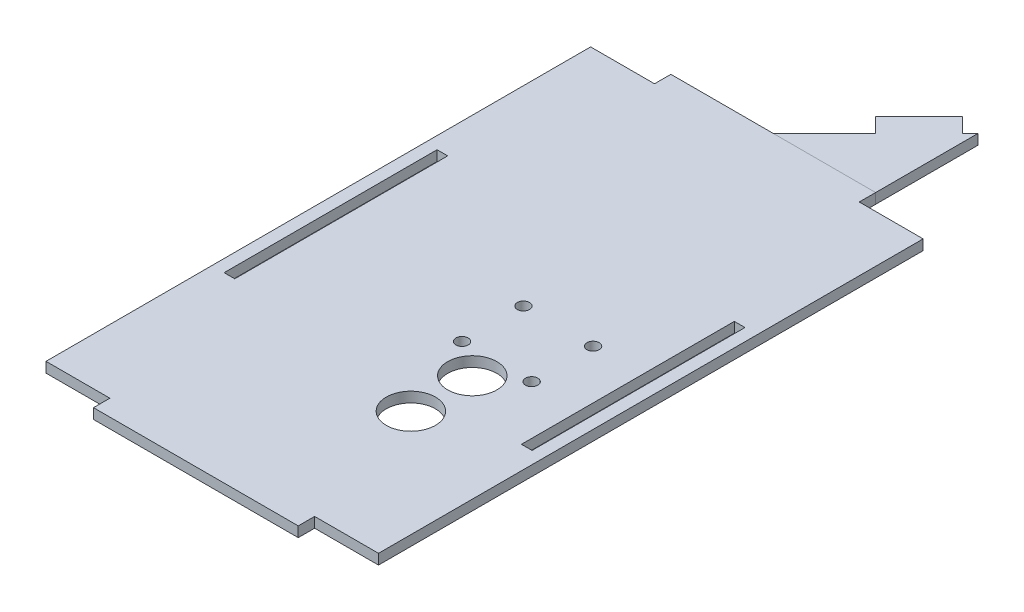
ISO-10303-21;
HEADER;
FILE_DESCRIPTION(('STEP AP214'),'2;1');
FILE_NAME('part.step','',(''),(''),'','','');
FILE_SCHEMA(('AUTOMOTIVE_DESIGN { 1 0 10303 214 1 1 1 1 }'));
ENDSEC;
DATA;
#1=APPLICATION_CONTEXT('core data for automotive mechanical design processes');
#2=APPLICATION_PROTOCOL_DEFINITION('international standard','automotive_design',2000,#1);
#3=PRODUCT_CONTEXT('',#1,'mechanical');
#4=PRODUCT('Part','Part','',(#3));
#5=PRODUCT_RELATED_PRODUCT_CATEGORY('part','',(#4));
#6=PRODUCT_DEFINITION_FORMATION('','',#4);
#7=PRODUCT_DEFINITION_CONTEXT('part definition',#1,'design');
#8=PRODUCT_DEFINITION('design','',#6,#7);
#9=PRODUCT_DEFINITION_SHAPE('','',#8);
#10=(LENGTH_UNIT() NAMED_UNIT(*) SI_UNIT(.MILLI.,.METRE.));
#11=(NAMED_UNIT(*) PLANE_ANGLE_UNIT() SI_UNIT($,.RADIAN.));
#12=(NAMED_UNIT(*) SI_UNIT($,.STERADIAN.) SOLID_ANGLE_UNIT());
#13=UNCERTAINTY_MEASURE_WITH_UNIT(LENGTH_MEASURE(1.E-05),#10,'distance_accuracy_value','');
#14=(GEOMETRIC_REPRESENTATION_CONTEXT(3) GLOBAL_UNCERTAINTY_ASSIGNED_CONTEXT((#13)) GLOBAL_UNIT_ASSIGNED_CONTEXT((#10,
#11,#12)) REPRESENTATION_CONTEXT('',''));
#15=CARTESIAN_POINT('',(0.,0.,0.));
#16=DIRECTION('',(0.,0.,1.));
#17=DIRECTION('',(1.,0.,0.));
#18=AXIS2_PLACEMENT_3D('',#15,#16,#17);
#19=CARTESIAN_POINT('',(-35.25,0.,-35.2499999999994));
#20=DIRECTION('',(0.707106781186553,0.,0.707106781186542));
#21=DIRECTION('',(0.707106781186542,0.,-0.707106781186553));
#22=AXIS2_PLACEMENT_3D('',#19,#20,#21);
#23=PLANE('',#22);
#24=DIRECTION('',(0.707106781186542,0.,-0.707106781186553));
#25=VECTOR('',#24,1.);
#26=CARTESIAN_POINT('',(-35.25,2.5,-35.2499999999994));
#27=LINE('',#26,#25);
#28=CARTESIAN_POINT('',(23.1066017177981,2.5,-93.6066017177986));
#29=VERTEX_POINT('',#28);
#30=CARTESIAN_POINT('',(25.,2.5,-95.5000000000004));
#31=VERTEX_POINT('',#30);
#32=EDGE_CURVE('E139',#29,#31,#27,.T.);
#33=ORIENTED_EDGE('',*,*,#32,.T.);
#34=DIRECTION('',(0.,1.,0.));
#35=VECTOR('',#34,1.);
#36=CARTESIAN_POINT('',(25.,0.,-95.5000000000004));
#37=LINE('',#36,#35);
#38=CARTESIAN_POINT('',(25.,0.,-95.5000000000004));
#39=VERTEX_POINT('',#38);
#40=EDGE_CURVE('E12',#39,#31,#37,.T.);
#41=ORIENTED_EDGE('',*,*,#40,.F.);
#42=DIRECTION('',(0.707106781186542,0.,-0.707106781186553));
#43=VECTOR('',#42,1.);
#44=CARTESIAN_POINT('',(-35.25,0.,-35.2499999999994));
#45=LINE('',#44,#43);
#46=CARTESIAN_POINT('',(23.1066017177981,0.,-93.6066017177986));
#47=VERTEX_POINT('',#46);
#48=EDGE_CURVE('E151',#47,#39,#45,.T.);
#49=ORIENTED_EDGE('',*,*,#48,.F.);
#50=DIRECTION('',(0.,1.,0.));
#51=VECTOR('',#50,1.);
#52=CARTESIAN_POINT('',(23.1066017177981,0.,-93.6066017177986));
#53=LINE('',#52,#51);
#54=EDGE_CURVE('E53',#47,#29,#53,.T.);
#55=ORIENTED_EDGE('',*,*,#54,.T.);
#56=EDGE_LOOP('',(#33,#41,#49,#55));
#57=FACE_BOUND('',#56,.T.);
#58=ADVANCED_FACE('F50',(#57),#23,.F.);
#59=CARTESIAN_POINT('',(25.,0.,0.));
#60=DIRECTION('',(-1.,0.,0.));
#61=DIRECTION('',(0.,0.,1.));
#62=AXIS2_PLACEMENT_3D('',#59,#60,#61);
#63=PLANE('',#62);
#64=DIRECTION('',(0.,0.,1.));
#65=VECTOR('',#64,1.);
#66=CARTESIAN_POINT('',(25.,2.5,0.));
#67=LINE('',#66,#65);
#68=CARTESIAN_POINT('',(25.,2.5,-70.5000000000002));
#69=VERTEX_POINT('',#68);
#70=EDGE_CURVE('E90',#31,#69,#67,.T.);
#71=ORIENTED_EDGE('',*,*,#70,.T.);
#72=DIRECTION('',(0.,1.,0.));
#73=VECTOR('',#72,1.);
#74=CARTESIAN_POINT('',(25.,0.,-70.5000000000002));
#75=LINE('',#74,#73);
#76=CARTESIAN_POINT('',(25.,0.,-70.5000000000002));
#77=VERTEX_POINT('',#76);
#78=EDGE_CURVE('E59',#77,#69,#75,.T.);
#79=ORIENTED_EDGE('',*,*,#78,.F.);
#80=DIRECTION('',(0.,0.,1.));
#81=VECTOR('',#80,1.);
#82=CARTESIAN_POINT('',(25.,0.,0.));
#83=LINE('',#82,#81);
#84=EDGE_CURVE('E67',#39,#77,#83,.T.);
#85=ORIENTED_EDGE('',*,*,#84,.F.);
#86=ORIENTED_EDGE('',*,*,#40,.T.);
#87=EDGE_LOOP('',(#71,#79,#85,#86));
#88=FACE_BOUND('',#87,.T.);
#89=ADVANCED_FACE('F181',(#88),#63,.F.);
#90=CARTESIAN_POINT('',(0.,0.,-70.5000000000002));
#91=DIRECTION('',(0.,0.,-1.));
#92=DIRECTION('',(-1.,0.,0.));
#93=AXIS2_PLACEMENT_3D('',#90,#91,#92);
#94=PLANE('',#93);
#95=DIRECTION('',(-1.,0.,0.));
#96=VECTOR('',#95,1.);
#97=CARTESIAN_POINT('',(0.,2.5,-70.5000000000002));
#98=LINE('',#97,#96);
#99=CARTESIAN_POINT('',(0.,2.5,-70.5000000000002));
#100=VERTEX_POINT('',#99);
#101=EDGE_CURVE('E124',#69,#100,#98,.T.);
#102=ORIENTED_EDGE('',*,*,#101,.T.);
#103=DIRECTION('',(0.,1.,0.));
#104=VECTOR('',#103,1.);
#105=CARTESIAN_POINT('',(0.,0.,-70.5000000000002));
#106=LINE('',#105,#104);
#107=CARTESIAN_POINT('',(0.,0.,-70.5000000000002));
#108=VERTEX_POINT('',#107);
#109=EDGE_CURVE('E122',#108,#100,#106,.T.);
#110=ORIENTED_EDGE('',*,*,#109,.F.);
#111=DIRECTION('',(-1.,0.,0.));
#112=VECTOR('',#111,1.);
#113=CARTESIAN_POINT('',(0.,0.,-70.5000000000002));
#114=LINE('',#113,#112);
#115=EDGE_CURVE('E113',#77,#108,#114,.T.);
#116=ORIENTED_EDGE('',*,*,#115,.F.);
#117=ORIENTED_EDGE('',*,*,#78,.T.);
#118=EDGE_LOOP('',(#102,#110,#116,#117));
#119=FACE_BOUND('',#118,.T.);
#120=ADVANCED_FACE('F123',(#119),#94,.F.);
#121=CARTESIAN_POINT('',(-35.2500000000001,0.,-35.2499999999998));
#122=DIRECTION('',(0.707106781186551,0.,0.707106781186545));
#123=DIRECTION('',(0.707106781186545,0.,-0.707106781186551));
#124=AXIS2_PLACEMENT_3D('',#121,#122,#123);
#125=PLANE('',#124);
#126=DIRECTION('',(0.707106781186545,0.,-0.707106781186551));
#127=VECTOR('',#126,1.);
#128=CARTESIAN_POINT('',(-35.2500000000001,2.5,-35.2499999999998));
#129=LINE('',#128,#127);
#130=CARTESIAN_POINT('',(12.5,2.5,-83.0000000000003));
#131=VERTEX_POINT('',#130);
#132=EDGE_CURVE('E148',#100,#131,#129,.T.);
#133=ORIENTED_EDGE('',*,*,#132,.T.);
#134=DIRECTION('',(0.,1.,0.));
#135=VECTOR('',#134,1.);
#136=CARTESIAN_POINT('',(12.5,0.,-83.0000000000003));
#137=LINE('',#136,#135);
#138=CARTESIAN_POINT('',(12.5,0.,-83.0000000000003));
#139=VERTEX_POINT('',#138);
#140=EDGE_CURVE('E127',#139,#131,#137,.T.);
#141=ORIENTED_EDGE('',*,*,#140,.F.);
#142=DIRECTION('',(0.707106781186545,0.,-0.707106781186551));
#143=VECTOR('',#142,1.);
#144=CARTESIAN_POINT('',(-35.2500000000001,0.,-35.2499999999998));
#145=LINE('',#144,#143);
#146=EDGE_CURVE('E117',#108,#139,#145,.T.);
#147=ORIENTED_EDGE('',*,*,#146,.F.);
#148=ORIENTED_EDGE('',*,*,#109,.T.);
#149=EDGE_LOOP('',(#133,#141,#147,#148));
#150=FACE_BOUND('',#149,.T.);
#151=ADVANCED_FACE('F129',(#150),#125,.F.);
#152=CARTESIAN_POINT('',(47.7500000000001,0.,-47.7500000000007));
#153=DIRECTION('',(0.707106781186543,0.,-0.707106781186552));
#154=DIRECTION('',(-0.707106781186552,0.,-0.707106781186543));
#155=AXIS2_PLACEMENT_3D('',#152,#153,#154);
#156=PLANE('',#155);
#157=DIRECTION('',(-0.707106781186552,0.,-0.707106781186543));
#158=VECTOR('',#157,1.);
#159=CARTESIAN_POINT('',(47.7500000000001,2.5,-47.7500000000007));
#160=LINE('',#159,#158);
#161=CARTESIAN_POINT('',(8.96446609406724,2.5,-86.535533905933));
#162=VERTEX_POINT('',#161);
#163=EDGE_CURVE('E146',#131,#162,#160,.T.);
#164=ORIENTED_EDGE('',*,*,#163,.T.);
#165=DIRECTION('',(0.,1.,0.));
#166=VECTOR('',#165,1.);
#167=CARTESIAN_POINT('',(8.96446609406724,0.,-86.535533905933));
#168=LINE('',#167,#166);
#169=CARTESIAN_POINT('',(8.96446609406724,0.,-86.535533905933));
#170=VERTEX_POINT('',#169);
#171=EDGE_CURVE('E155',#170,#162,#168,.T.);
#172=ORIENTED_EDGE('',*,*,#171,.F.);
#173=DIRECTION('',(-0.707106781186552,0.,-0.707106781186543));
#174=VECTOR('',#173,1.);
#175=CARTESIAN_POINT('',(47.7500000000001,0.,-47.7500000000007));
#176=LINE('',#175,#174);
#177=EDGE_CURVE('E132',#139,#170,#176,.T.);
#178=ORIENTED_EDGE('',*,*,#177,.F.);
#179=ORIENTED_EDGE('',*,*,#140,.T.);
#180=EDGE_LOOP('',(#164,#172,#178,#179));
#181=FACE_BOUND('',#180,.T.);
#182=ADVANCED_FACE('F177',(#181),#156,.F.);
#183=CARTESIAN_POINT('',(-38.7855339059328,0.,-38.7855339059324));
#184=DIRECTION('',(0.707106781186551,0.,0.707106781186544));
#185=DIRECTION('',(0.707106781186544,0.,-0.707106781186551));
#186=AXIS2_PLACEMENT_3D('',#183,#184,#185);
#187=PLANE('',#186);
#188=DIRECTION('',(0.707106781186544,0.,-0.707106781186551));
#189=VECTOR('',#188,1.);
#190=CARTESIAN_POINT('',(-38.7855339059328,2.5,-38.7855339059324));
#191=LINE('',#190,#189);
#192=CARTESIAN_POINT('',(19.5710678118654,2.5,-97.1421356237313));
#193=VERTEX_POINT('',#192);
#194=EDGE_CURVE('E144',#162,#193,#191,.T.);
#195=ORIENTED_EDGE('',*,*,#194,.T.);
#196=DIRECTION('',(0.,1.,0.));
#197=VECTOR('',#196,1.);
#198=CARTESIAN_POINT('',(19.5710678118654,0.,-97.1421356237313));
#199=LINE('',#198,#197);
#200=CARTESIAN_POINT('',(19.5710678118654,0.,-97.1421356237313));
#201=VERTEX_POINT('',#200);
#202=EDGE_CURVE('E157',#201,#193,#199,.T.);
#203=ORIENTED_EDGE('',*,*,#202,.F.);
#204=DIRECTION('',(0.707106781186544,0.,-0.707106781186551));
#205=VECTOR('',#204,1.);
#206=CARTESIAN_POINT('',(-38.7855339059328,0.,-38.7855339059324));
#207=LINE('',#206,#205);
#208=EDGE_CURVE('E134',#170,#201,#207,.T.);
#209=ORIENTED_EDGE('',*,*,#208,.F.);
#210=ORIENTED_EDGE('',*,*,#171,.T.);
#211=EDGE_LOOP('',(#195,#203,#209,#210));
#212=FACE_BOUND('',#211,.T.);
#213=ADVANCED_FACE('F171',(#212),#187,.F.);
#214=CARTESIAN_POINT('',(58.3566017177982,0.,-58.356601717799));
#215=DIRECTION('',(-0.707106781186543,0.,0.707106781186552));
#216=DIRECTION('',(0.707106781186552,0.,0.707106781186543));
#217=AXIS2_PLACEMENT_3D('',#214,#215,#216);
#218=PLANE('',#217);
#219=DIRECTION('',(0.707106781186552,0.,0.707106781186543));
#220=VECTOR('',#219,1.);
#221=CARTESIAN_POINT('',(58.3566017177982,2.5,-58.356601717799));
#222=LINE('',#221,#220);
#223=EDGE_CURVE('E142',#193,#29,#222,.T.);
#224=ORIENTED_EDGE('',*,*,#223,.T.);
#225=ORIENTED_EDGE('',*,*,#54,.F.);
#226=DIRECTION('',(0.707106781186552,0.,0.707106781186543));
#227=VECTOR('',#226,1.);
#228=CARTESIAN_POINT('',(58.3566017177982,0.,-58.356601717799));
#229=LINE('',#228,#227);
#230=EDGE_CURVE('E102',#201,#47,#229,.T.);
#231=ORIENTED_EDGE('',*,*,#230,.F.);
#232=ORIENTED_EDGE('',*,*,#202,.T.);
#233=EDGE_LOOP('',(#224,#225,#231,#232));
#234=FACE_BOUND('',#233,.T.);
#235=ADVANCED_FACE('F169',(#234),#218,.F.);
#236=CARTESIAN_POINT('',(0.,0.,0.));
#237=DIRECTION('',(0.,1.,0.));
#238=DIRECTION('',(0.,0.,1.));
#239=AXIS2_PLACEMENT_3D('',#236,#237,#238);
#240=PLANE('',#239);
#241=ORIENTED_EDGE('',*,*,#48,.T.);
#242=ORIENTED_EDGE('',*,*,#84,.T.);
#243=ORIENTED_EDGE('',*,*,#115,.T.);
#244=ORIENTED_EDGE('',*,*,#146,.T.);
#245=ORIENTED_EDGE('',*,*,#177,.T.);
#246=ORIENTED_EDGE('',*,*,#208,.T.);
#247=ORIENTED_EDGE('',*,*,#230,.T.);
#248=EDGE_LOOP('',(#241,#242,#243,#244,#245,#246,#247));
#249=FACE_BOUND('',#248,.T.);
#250=ADVANCED_FACE('F115',(#249),#240,.F.);
#251=CARTESIAN_POINT('',(0.,2.5,0.));
#252=DIRECTION('',(0.,1.,0.));
#253=DIRECTION('',(0.,0.,1.));
#254=AXIS2_PLACEMENT_3D('',#251,#252,#253);
#255=PLANE('',#254);
#256=ORIENTED_EDGE('',*,*,#32,.F.);
#257=ORIENTED_EDGE('',*,*,#223,.F.);
#258=ORIENTED_EDGE('',*,*,#194,.F.);
#259=ORIENTED_EDGE('',*,*,#163,.F.);
#260=ORIENTED_EDGE('',*,*,#132,.F.);
#261=ORIENTED_EDGE('',*,*,#101,.F.);
#262=ORIENTED_EDGE('',*,*,#70,.F.);
#263=EDGE_LOOP('',(#256,#257,#258,#259,#260,#261,#262));
#264=FACE_BOUND('',#263,.T.);
#265=ADVANCED_FACE('F166',(#264),#255,.T.);
#266=CLOSED_SHELL('',(#58,#89,#120,#151,#182,#213,#235,#250,#265));
#267=MANIFOLD_SOLID_BREP('B2',#266);
#268=CARTESIAN_POINT('',(0.,2.5,0.));
#269=DIRECTION('',(0.,-1.,0.));
#270=DIRECTION('',(0.,0.,-1.));
#271=AXIS2_PLACEMENT_3D('',#268,#269,#270);
#272=PLANE('',#271);
#273=CARTESIAN_POINT('',(14.5,2.5,17.5));
#274=DIRECTION('',(0.,1.,0.));
#275=DIRECTION('',(0.,0.,1.));
#276=AXIS2_PLACEMENT_3D('',#273,#274,#275);
#277=CIRCLE('',#276,6.);
#278=CARTESIAN_POINT('',(14.5,2.5,23.5));
#279=VERTEX_POINT('',#278);
#280=EDGE_CURVE('E854',#279,#279,#277,.T.);
#281=ORIENTED_EDGE('',*,*,#280,.F.);
#282=EDGE_LOOP('',(#281));
#283=FACE_BOUND('',#282,.T.);
#284=CARTESIAN_POINT('',(6.00000000000001,2.5,-3.49999999999999));
#285=DIRECTION('',(0.,1.,0.));
#286=DIRECTION('',(0.,0.,1.));
#287=AXIS2_PLACEMENT_3D('',#284,#285,#286);
#288=CIRCLE('',#287,1.5);
#289=CARTESIAN_POINT('',(6.00000000000001,2.5,-1.99999999999999));
#290=VERTEX_POINT('',#289);
#291=EDGE_CURVE('E860',#290,#290,#288,.T.);
#292=ORIENTED_EDGE('',*,*,#291,.F.);
#293=EDGE_LOOP('',(#292));
#294=FACE_BOUND('',#293,.T.);
#295=CARTESIAN_POINT('',(23.,2.5,-3.49999999999999));
#296=DIRECTION('',(0.,1.,0.));
#297=DIRECTION('',(0.,0.,1.));
#298=AXIS2_PLACEMENT_3D('',#295,#296,#297);
#299=CIRCLE('',#298,1.5);
#300=CARTESIAN_POINT('',(23.,2.5,-1.99999999999998));
#301=VERTEX_POINT('',#300);
#302=EDGE_CURVE('E868',#301,#301,#299,.T.);
#303=ORIENTED_EDGE('',*,*,#302,.F.);
#304=EDGE_LOOP('',(#303));
#305=FACE_BOUND('',#304,.T.);
#306=CARTESIAN_POINT('',(6.00000000000001,2.5,11.5));
#307=DIRECTION('',(0.,-1.,0.));
#308=DIRECTION('',(0.,0.,-1.));
#309=AXIS2_PLACEMENT_3D('',#306,#307,#308);
#310=CIRCLE('',#309,1.5);
#311=CARTESIAN_POINT('',(6.00000000000001,2.5,10.));
#312=VERTEX_POINT('',#311);
#313=EDGE_CURVE('E871',#312,#312,#310,.T.);
#314=ORIENTED_EDGE('',*,*,#313,.T.);
#315=EDGE_LOOP('',(#314));
#316=FACE_BOUND('',#315,.T.);
#317=CARTESIAN_POINT('',(23.,2.5,11.5));
#318=DIRECTION('',(0.,-1.,0.));
#319=DIRECTION('',(0.,0.,-1.));
#320=AXIS2_PLACEMENT_3D('',#317,#318,#319);
#321=CIRCLE('',#320,1.5);
#322=CARTESIAN_POINT('',(23.,2.5,10.));
#323=VERTEX_POINT('',#322);
#324=EDGE_CURVE('E857',#323,#323,#321,.T.);
#325=ORIENTED_EDGE('',*,*,#324,.T.);
#326=EDGE_LOOP('',(#325));
#327=FACE_BOUND('',#326,.T.);
#328=CARTESIAN_POINT('',(14.5,2.5,32.5));
#329=DIRECTION('',(0.,-1.,0.));
#330=DIRECTION('',(0.,0.,-1.));
#331=AXIS2_PLACEMENT_3D('',#328,#329,#330);
#332=CIRCLE('',#331,6.);
#333=CARTESIAN_POINT('',(14.5,2.5,26.5));
#334=VERTEX_POINT('',#333);
#335=EDGE_CURVE('E419',#334,#334,#332,.T.);
#336=ORIENTED_EDGE('',*,*,#335,.T.);
#337=EDGE_LOOP('',(#336));
#338=FACE_BOUND('',#337,.T.);
#339=DIRECTION('',(1.,0.,0.));
#340=VECTOR('',#339,1.);
#341=CARTESIAN_POINT('',(37.6,2.5,26.));
#342=LINE('',#341,#340);
#343=CARTESIAN_POINT('',(35.,2.5,26.));
#344=VERTEX_POINT('',#343);
#345=CARTESIAN_POINT('',(37.6,2.5,26.));
#346=VERTEX_POINT('',#345);
#347=EDGE_CURVE('E429',#344,#346,#342,.T.);
#348=ORIENTED_EDGE('',*,*,#347,.F.);
#349=DIRECTION('',(0.,0.,1.));
#350=VECTOR('',#349,1.);
#351=CARTESIAN_POINT('',(35.,2.5,26.));
#352=LINE('',#351,#350);
#353=CARTESIAN_POINT('',(35.,2.5,-26.));
#354=VERTEX_POINT('',#353);
#355=EDGE_CURVE('E437',#354,#344,#352,.T.);
#356=ORIENTED_EDGE('',*,*,#355,.F.);
#357=DIRECTION('',(-1.,0.,0.));
#358=VECTOR('',#357,1.);
#359=CARTESIAN_POINT('',(37.6,2.5,-26.));
#360=LINE('',#359,#358);
#361=CARTESIAN_POINT('',(37.6,2.5,-26.));
#362=VERTEX_POINT('',#361);
#363=EDGE_CURVE('E434',#362,#354,#360,.T.);
#364=ORIENTED_EDGE('',*,*,#363,.F.);
#365=DIRECTION('',(0.,0.,-1.));
#366=VECTOR('',#365,1.);
#367=CARTESIAN_POINT('',(37.6,2.5,26.));
#368=LINE('',#367,#366);
#369=EDGE_CURVE('E431',#346,#362,#368,.T.);
#370=ORIENTED_EDGE('',*,*,#369,.F.);
#371=EDGE_LOOP('',(#348,#356,#364,#370));
#372=FACE_BOUND('',#371,.T.);
#373=DIRECTION('',(0.,0.,-1.));
#374=VECTOR('',#373,1.);
#375=CARTESIAN_POINT('',(25.,2.5,-66.5));
#376=LINE('',#375,#374);
#377=CARTESIAN_POINT('',(25.,2.5,-66.5));
#378=VERTEX_POINT('',#377);
#379=CARTESIAN_POINT('',(25.,2.5,-70.5000000000002));
#380=VERTEX_POINT('',#379);
#381=EDGE_CURVE('E460',#378,#380,#376,.T.);
#382=ORIENTED_EDGE('',*,*,#381,.T.);
#383=DIRECTION('',(-1.,0.,0.));
#384=VECTOR('',#383,1.);
#385=CARTESIAN_POINT('',(-25.,2.5,-70.5000000000002));
#386=LINE('',#385,#384);
#387=CARTESIAN_POINT('',(-25.,2.5,-70.5000000000002));
#388=VERTEX_POINT('',#387);
#389=EDGE_CURVE('E463',#380,#388,#386,.T.);
#390=ORIENTED_EDGE('',*,*,#389,.T.);
#391=DIRECTION('',(0.,0.,1.));
#392=VECTOR('',#391,1.);
#393=CARTESIAN_POINT('',(-25.,2.5,-66.4999999999999));
#394=LINE('',#393,#392);
#395=CARTESIAN_POINT('',(-25.,2.5,-66.4999999999999));
#396=VERTEX_POINT('',#395);
#397=EDGE_CURVE('E466',#388,#396,#394,.T.);
#398=ORIENTED_EDGE('',*,*,#397,.T.);
#399=DIRECTION('',(-1.,0.,0.));
#400=VECTOR('',#399,1.);
#401=CARTESIAN_POINT('',(-25.,2.5,-66.4999999999999));
#402=LINE('',#401,#400);
#403=CARTESIAN_POINT('',(-40.6,2.5,-66.5));
#404=VERTEX_POINT('',#403);
#405=EDGE_CURVE('E468',#396,#404,#402,.T.);
#406=ORIENTED_EDGE('',*,*,#405,.T.);
#407=DIRECTION('',(0.,0.,1.));
#408=VECTOR('',#407,1.);
#409=CARTESIAN_POINT('',(-40.6,2.5,-66.5));
#410=LINE('',#409,#408);
#411=CARTESIAN_POINT('',(-40.6,2.5,66.5));
#412=VERTEX_POINT('',#411);
#413=EDGE_CURVE('E470',#404,#412,#410,.T.);
#414=ORIENTED_EDGE('',*,*,#413,.T.);
#415=DIRECTION('',(1.,0.,0.));
#416=VECTOR('',#415,1.);
#417=CARTESIAN_POINT('',(-40.6,2.5,66.5));
#418=LINE('',#417,#416);
#419=CARTESIAN_POINT('',(-25.,2.5,66.5));
#420=VERTEX_POINT('',#419);
#421=EDGE_CURVE('E472',#412,#420,#418,.T.);
#422=ORIENTED_EDGE('',*,*,#421,.T.);
#423=DIRECTION('',(0.,0.,1.));
#424=VECTOR('',#423,1.);
#425=CARTESIAN_POINT('',(-25.,2.5,66.5));
#426=LINE('',#425,#424);
#427=CARTESIAN_POINT('',(-25.,2.5,70.5000000000002));
#428=VERTEX_POINT('',#427);
#429=EDGE_CURVE('E474',#420,#428,#426,.T.);
#430=ORIENTED_EDGE('',*,*,#429,.T.);
#431=DIRECTION('',(1.,0.,0.));
#432=VECTOR('',#431,1.);
#433=CARTESIAN_POINT('',(-25.,2.5,70.5000000000002));
#434=LINE('',#433,#432);
#435=CARTESIAN_POINT('',(25.,2.5,70.5000000000002));
#436=VERTEX_POINT('',#435);
#437=EDGE_CURVE('E476',#428,#436,#434,.T.);
#438=ORIENTED_EDGE('',*,*,#437,.T.);
#439=DIRECTION('',(0.,0.,-1.));
#440=VECTOR('',#439,1.);
#441=CARTESIAN_POINT('',(25.,2.5,66.5));
#442=LINE('',#441,#440);
#443=CARTESIAN_POINT('',(25.,2.5,66.5));
#444=VERTEX_POINT('',#443);
#445=EDGE_CURVE('E478',#436,#444,#442,.T.);
#446=ORIENTED_EDGE('',*,*,#445,.T.);
#447=DIRECTION('',(1.,0.,0.));
#448=VECTOR('',#447,1.);
#449=CARTESIAN_POINT('',(40.6,2.5,66.5));
#450=LINE('',#449,#448);
#451=CARTESIAN_POINT('',(40.6,2.5,66.5));
#452=VERTEX_POINT('',#451);
#453=EDGE_CURVE('E480',#444,#452,#450,.T.);
#454=ORIENTED_EDGE('',*,*,#453,.T.);
#455=DIRECTION('',(0.,0.,-1.));
#456=VECTOR('',#455,1.);
#457=CARTESIAN_POINT('',(40.6,2.5,-66.5));
#458=LINE('',#457,#456);
#459=CARTESIAN_POINT('',(40.6,2.5,-66.5));
#460=VERTEX_POINT('',#459);
#461=EDGE_CURVE('E482',#452,#460,#458,.T.);
#462=ORIENTED_EDGE('',*,*,#461,.T.);
#463=DIRECTION('',(-1.,0.,0.));
#464=VECTOR('',#463,1.);
#465=CARTESIAN_POINT('',(25.,2.5,-66.5));
#466=LINE('',#465,#464);
#467=EDGE_CURVE('E484',#460,#378,#466,.T.);
#468=ORIENTED_EDGE('',*,*,#467,.T.);
#469=EDGE_LOOP('',(#382,#390,#398,#406,#414,#422,#430,#438,#446,#454,#462,#468));
#470=FACE_BOUND('',#469,.T.);
#471=DIRECTION('',(0.,0.,1.));
#472=VECTOR('',#471,1.);
#473=CARTESIAN_POINT('',(-37.6,2.5,26.));
#474=LINE('',#473,#472);
#475=CARTESIAN_POINT('',(-37.6,2.5,-26.));
#476=VERTEX_POINT('',#475);
#477=CARTESIAN_POINT('',(-37.6,2.5,26.));
#478=VERTEX_POINT('',#477);
#479=EDGE_CURVE('E391',#476,#478,#474,.T.);
#480=ORIENTED_EDGE('',*,*,#479,.F.);
#481=DIRECTION('',(-1.,0.,0.));
#482=VECTOR('',#481,1.);
#483=CARTESIAN_POINT('',(-37.6,2.5,-26.));
#484=LINE('',#483,#482);
#485=CARTESIAN_POINT('',(-35.,2.5,-26.));
#486=VERTEX_POINT('',#485);
#487=EDGE_CURVE('E413',#486,#476,#484,.T.);
#488=ORIENTED_EDGE('',*,*,#487,.F.);
#489=DIRECTION('',(0.,0.,-1.));
#490=VECTOR('',#489,1.);
#491=CARTESIAN_POINT('',(-35.,2.5,26.));
#492=LINE('',#491,#490);
#493=CARTESIAN_POINT('',(-35.,2.5,26.));
#494=VERTEX_POINT('',#493);
#495=EDGE_CURVE('E411',#494,#486,#492,.T.);
#496=ORIENTED_EDGE('',*,*,#495,.F.);
#497=DIRECTION('',(1.,0.,0.));
#498=VECTOR('',#497,1.);
#499=CARTESIAN_POINT('',(-37.6,2.5,26.));
#500=LINE('',#499,#498);
#501=EDGE_CURVE('E399',#478,#494,#500,.T.);
#502=ORIENTED_EDGE('',*,*,#501,.F.);
#503=EDGE_LOOP('',(#480,#488,#496,#502));
#504=FACE_BOUND('',#503,.T.);
#505=ADVANCED_FACE('F254',(#283,#294,#305,#316,#327,#338,#372,#470,#504),#272,.F.);
#506=CARTESIAN_POINT('',(0.,0.,0.));
#507=DIRECTION('',(0.,-1.,0.));
#508=DIRECTION('',(0.,0.,-1.));
#509=AXIS2_PLACEMENT_3D('',#506,#507,#508);
#510=PLANE('',#509);
#511=CARTESIAN_POINT('',(14.5,0.,17.5));
#512=DIRECTION('',(0.,1.,0.));
#513=DIRECTION('',(0.,0.,1.));
#514=AXIS2_PLACEMENT_3D('',#511,#512,#513);
#515=CIRCLE('',#514,6.);
#516=CARTESIAN_POINT('',(14.5,0.,23.5));
#517=VERTEX_POINT('',#516);
#518=EDGE_CURVE('E852',#517,#517,#515,.T.);
#519=ORIENTED_EDGE('',*,*,#518,.T.);
#520=EDGE_LOOP('',(#519));
#521=FACE_BOUND('',#520,.T.);
#522=CARTESIAN_POINT('',(6.00000000000001,0.,-3.49999999999999));
#523=DIRECTION('',(0.,1.,0.));
#524=DIRECTION('',(0.,0.,1.));
#525=AXIS2_PLACEMENT_3D('',#522,#523,#524);
#526=CIRCLE('',#525,1.5);
#527=CARTESIAN_POINT('',(6.00000000000001,0.,-1.99999999999999));
#528=VERTEX_POINT('',#527);
#529=EDGE_CURVE('E855',#528,#528,#526,.T.);
#530=ORIENTED_EDGE('',*,*,#529,.T.);
#531=EDGE_LOOP('',(#530));
#532=FACE_BOUND('',#531,.T.);
#533=CARTESIAN_POINT('',(23.,0.,-3.49999999999999));
#534=DIRECTION('',(0.,1.,0.));
#535=DIRECTION('',(0.,0.,1.));
#536=AXIS2_PLACEMENT_3D('',#533,#534,#535);
#537=CIRCLE('',#536,1.5);
#538=CARTESIAN_POINT('',(23.,0.,-1.99999999999998));
#539=VERTEX_POINT('',#538);
#540=EDGE_CURVE('E865',#539,#539,#537,.T.);
#541=ORIENTED_EDGE('',*,*,#540,.T.);
#542=EDGE_LOOP('',(#541));
#543=FACE_BOUND('',#542,.T.);
#544=CARTESIAN_POINT('',(6.00000000000001,0.,11.5));
#545=DIRECTION('',(0.,-1.,0.));
#546=DIRECTION('',(0.,0.,-1.));
#547=AXIS2_PLACEMENT_3D('',#544,#545,#546);
#548=CIRCLE('',#547,1.5);
#549=CARTESIAN_POINT('',(6.00000000000001,0.,10.));
#550=VERTEX_POINT('',#549);
#551=EDGE_CURVE('E875',#550,#550,#548,.T.);
#552=ORIENTED_EDGE('',*,*,#551,.F.);
#553=EDGE_LOOP('',(#552));
#554=FACE_BOUND('',#553,.T.);
#555=CARTESIAN_POINT('',(23.,0.,11.5));
#556=DIRECTION('',(0.,-1.,0.));
#557=DIRECTION('',(0.,0.,-1.));
#558=AXIS2_PLACEMENT_3D('',#555,#556,#557);
#559=CIRCLE('',#558,1.5);
#560=CARTESIAN_POINT('',(23.,0.,10.));
#561=VERTEX_POINT('',#560);
#562=EDGE_CURVE('E878',#561,#561,#559,.T.);
#563=ORIENTED_EDGE('',*,*,#562,.F.);
#564=EDGE_LOOP('',(#563));
#565=FACE_BOUND('',#564,.T.);
#566=CARTESIAN_POINT('',(14.5,0.,32.5));
#567=DIRECTION('',(0.,-1.,0.));
#568=DIRECTION('',(0.,0.,-1.));
#569=AXIS2_PLACEMENT_3D('',#566,#567,#568);
#570=CIRCLE('',#569,6.);
#571=CARTESIAN_POINT('',(14.5,0.,26.5));
#572=VERTEX_POINT('',#571);
#573=EDGE_CURVE('E874',#572,#572,#570,.T.);
#574=ORIENTED_EDGE('',*,*,#573,.F.);
#575=EDGE_LOOP('',(#574));
#576=FACE_BOUND('',#575,.T.);
#577=DIRECTION('',(0.,0.,-1.));
#578=VECTOR('',#577,1.);
#579=CARTESIAN_POINT('',(25.,0.,-66.5));
#580=LINE('',#579,#578);
#581=CARTESIAN_POINT('',(25.,0.,-66.5));
#582=VERTEX_POINT('',#581);
#583=CARTESIAN_POINT('',(25.,0.,-70.5000000000002));
#584=VERTEX_POINT('',#583);
#585=EDGE_CURVE('E459',#582,#584,#580,.T.);
#586=ORIENTED_EDGE('',*,*,#585,.F.);
#587=DIRECTION('',(-1.,0.,0.));
#588=VECTOR('',#587,1.);
#589=CARTESIAN_POINT('',(25.,0.,-66.5));
#590=LINE('',#589,#588);
#591=CARTESIAN_POINT('',(40.6,0.,-66.5));
#592=VERTEX_POINT('',#591);
#593=EDGE_CURVE('E464',#592,#582,#590,.T.);
#594=ORIENTED_EDGE('',*,*,#593,.F.);
#595=DIRECTION('',(0.,0.,-1.));
#596=VECTOR('',#595,1.);
#597=CARTESIAN_POINT('',(40.6,0.,-66.5));
#598=LINE('',#597,#596);
#599=CARTESIAN_POINT('',(40.6,0.,66.5));
#600=VERTEX_POINT('',#599);
#601=EDGE_CURVE('E507',#600,#592,#598,.T.);
#602=ORIENTED_EDGE('',*,*,#601,.F.);
#603=DIRECTION('',(1.,0.,0.));
#604=VECTOR('',#603,1.);
#605=CARTESIAN_POINT('',(40.6,0.,66.5));
#606=LINE('',#605,#604);
#607=CARTESIAN_POINT('',(25.,0.,66.5));
#608=VERTEX_POINT('',#607);
#609=EDGE_CURVE('E505',#608,#600,#606,.T.);
#610=ORIENTED_EDGE('',*,*,#609,.F.);
#611=DIRECTION('',(0.,0.,-1.));
#612=VECTOR('',#611,1.);
#613=CARTESIAN_POINT('',(25.,0.,66.5));
#614=LINE('',#613,#612);
#615=CARTESIAN_POINT('',(25.,0.,70.5000000000002));
#616=VERTEX_POINT('',#615);
#617=EDGE_CURVE('E503',#616,#608,#614,.T.);
#618=ORIENTED_EDGE('',*,*,#617,.F.);
#619=DIRECTION('',(1.,0.,0.));
#620=VECTOR('',#619,1.);
#621=CARTESIAN_POINT('',(-25.,0.,70.5000000000002));
#622=LINE('',#621,#620);
#623=CARTESIAN_POINT('',(-25.,0.,70.5000000000002));
#624=VERTEX_POINT('',#623);
#625=EDGE_CURVE('E501',#624,#616,#622,.T.);
#626=ORIENTED_EDGE('',*,*,#625,.F.);
#627=DIRECTION('',(0.,0.,1.));
#628=VECTOR('',#627,1.);
#629=CARTESIAN_POINT('',(-25.,0.,66.5));
#630=LINE('',#629,#628);
#631=CARTESIAN_POINT('',(-25.,0.,66.5));
#632=VERTEX_POINT('',#631);
#633=EDGE_CURVE('E499',#632,#624,#630,.T.);
#634=ORIENTED_EDGE('',*,*,#633,.F.);
#635=DIRECTION('',(1.,0.,0.));
#636=VECTOR('',#635,1.);
#637=CARTESIAN_POINT('',(-40.6,0.,66.5));
#638=LINE('',#637,#636);
#639=CARTESIAN_POINT('',(-40.6,0.,66.5));
#640=VERTEX_POINT('',#639);
#641=EDGE_CURVE('E497',#640,#632,#638,.T.);
#642=ORIENTED_EDGE('',*,*,#641,.F.);
#643=DIRECTION('',(0.,0.,1.));
#644=VECTOR('',#643,1.);
#645=CARTESIAN_POINT('',(-40.6,0.,-66.5));
#646=LINE('',#645,#644);
#647=CARTESIAN_POINT('',(-40.6,0.,-66.5));
#648=VERTEX_POINT('',#647);
#649=EDGE_CURVE('E495',#648,#640,#646,.T.);
#650=ORIENTED_EDGE('',*,*,#649,.F.);
#651=DIRECTION('',(-1.,0.,0.));
#652=VECTOR('',#651,1.);
#653=CARTESIAN_POINT('',(-25.,0.,-66.4999999999999));
#654=LINE('',#653,#652);
#655=CARTESIAN_POINT('',(-25.,0.,-66.4999999999999));
#656=VERTEX_POINT('',#655);
#657=EDGE_CURVE('E493',#656,#648,#654,.T.);
#658=ORIENTED_EDGE('',*,*,#657,.F.);
#659=DIRECTION('',(0.,0.,1.));
#660=VECTOR('',#659,1.);
#661=CARTESIAN_POINT('',(-25.,0.,-66.4999999999999));
#662=LINE('',#661,#660);
#663=CARTESIAN_POINT('',(-25.,0.,-70.5000000000002));
#664=VERTEX_POINT('',#663);
#665=EDGE_CURVE('E491',#664,#656,#662,.T.);
#666=ORIENTED_EDGE('',*,*,#665,.F.);
#667=DIRECTION('',(-1.,0.,0.));
#668=VECTOR('',#667,1.);
#669=CARTESIAN_POINT('',(-25.,0.,-70.5000000000002));
#670=LINE('',#669,#668);
#671=EDGE_CURVE('E489',#584,#664,#670,.T.);
#672=ORIENTED_EDGE('',*,*,#671,.F.);
#673=EDGE_LOOP('',(#586,#594,#602,#610,#618,#626,#634,#642,#650,#658,#666,#672));
#674=FACE_BOUND('',#673,.T.);
#675=DIRECTION('',(0.,0.,1.));
#676=VECTOR('',#675,1.);
#677=CARTESIAN_POINT('',(35.,0.,26.));
#678=LINE('',#677,#676);
#679=CARTESIAN_POINT('',(35.,0.,-26.));
#680=VERTEX_POINT('',#679);
#681=CARTESIAN_POINT('',(35.,0.,26.));
#682=VERTEX_POINT('',#681);
#683=EDGE_CURVE('E432',#680,#682,#678,.T.);
#684=ORIENTED_EDGE('',*,*,#683,.T.);
#685=DIRECTION('',(1.,0.,0.));
#686=VECTOR('',#685,1.);
#687=CARTESIAN_POINT('',(37.6,0.,26.));
#688=LINE('',#687,#686);
#689=CARTESIAN_POINT('',(37.6,0.,26.));
#690=VERTEX_POINT('',#689);
#691=EDGE_CURVE('E407',#682,#690,#688,.T.);
#692=ORIENTED_EDGE('',*,*,#691,.T.);
#693=DIRECTION('',(0.,0.,-1.));
#694=VECTOR('',#693,1.);
#695=CARTESIAN_POINT('',(37.6,0.,26.));
#696=LINE('',#695,#694);
#697=CARTESIAN_POINT('',(37.6,0.,-26.));
#698=VERTEX_POINT('',#697);
#699=EDGE_CURVE('E442',#690,#698,#696,.T.);
#700=ORIENTED_EDGE('',*,*,#699,.T.);
#701=DIRECTION('',(-1.,0.,0.));
#702=VECTOR('',#701,1.);
#703=CARTESIAN_POINT('',(37.6,0.,-26.));
#704=LINE('',#703,#702);
#705=EDGE_CURVE('E445',#698,#680,#704,.T.);
#706=ORIENTED_EDGE('',*,*,#705,.T.);
#707=EDGE_LOOP('',(#684,#692,#700,#706));
#708=FACE_BOUND('',#707,.T.);
#709=DIRECTION('',(-1.,0.,0.));
#710=VECTOR('',#709,1.);
#711=CARTESIAN_POINT('',(-37.6,0.,-26.));
#712=LINE('',#711,#710);
#713=CARTESIAN_POINT('',(-35.,0.,-26.));
#714=VERTEX_POINT('',#713);
#715=CARTESIAN_POINT('',(-37.6,0.,-26.));
#716=VERTEX_POINT('',#715);
#717=EDGE_CURVE('E400',#714,#716,#712,.T.);
#718=ORIENTED_EDGE('',*,*,#717,.T.);
#719=DIRECTION('',(0.,0.,1.));
#720=VECTOR('',#719,1.);
#721=CARTESIAN_POINT('',(-37.6,0.,26.));
#722=LINE('',#721,#720);
#723=CARTESIAN_POINT('',(-37.6,0.,26.));
#724=VERTEX_POINT('',#723);
#725=EDGE_CURVE('E277',#716,#724,#722,.T.);
#726=ORIENTED_EDGE('',*,*,#725,.T.);
#727=DIRECTION('',(1.,0.,0.));
#728=VECTOR('',#727,1.);
#729=CARTESIAN_POINT('',(-37.6,0.,26.));
#730=LINE('',#729,#728);
#731=CARTESIAN_POINT('',(-35.,0.,26.));
#732=VERTEX_POINT('',#731);
#733=EDGE_CURVE('E406',#724,#732,#730,.T.);
#734=ORIENTED_EDGE('',*,*,#733,.T.);
#735=DIRECTION('',(0.,0.,-1.));
#736=VECTOR('',#735,1.);
#737=CARTESIAN_POINT('',(-35.,0.,26.));
#738=LINE('',#737,#736);
#739=EDGE_CURVE('E421',#732,#714,#738,.T.);
#740=ORIENTED_EDGE('',*,*,#739,.T.);
#741=EDGE_LOOP('',(#718,#726,#734,#740));
#742=FACE_BOUND('',#741,.T.);
#743=ADVANCED_FACE('F549',(#521,#532,#543,#554,#565,#576,#674,#708,#742),#510,.T.);
#744=CARTESIAN_POINT('',(25.,2.5,-66.5));
#745=DIRECTION('',(-1.,0.,0.));
#746=DIRECTION('',(0.,0.,1.));
#747=AXIS2_PLACEMENT_3D('',#744,#745,#746);
#748=PLANE('',#747);
#749=ORIENTED_EDGE('',*,*,#585,.T.);
#750=DIRECTION('',(0.,-1.,0.));
#751=VECTOR('',#750,1.);
#752=CARTESIAN_POINT('',(25.,2.5,-70.5000000000002));
#753=LINE('',#752,#751);
#754=EDGE_CURVE('E48',#380,#584,#753,.T.);
#755=ORIENTED_EDGE('',*,*,#754,.F.);
#756=ORIENTED_EDGE('',*,*,#381,.F.);
#757=DIRECTION('',(0.,-1.,0.));
#758=VECTOR('',#757,1.);
#759=CARTESIAN_POINT('',(25.,2.5,-66.5));
#760=LINE('',#759,#758);
#761=EDGE_CURVE('E486',#378,#582,#760,.T.);
#762=ORIENTED_EDGE('',*,*,#761,.T.);
#763=EDGE_LOOP('',(#749,#755,#756,#762));
#764=FACE_BOUND('',#763,.T.);
#765=ADVANCED_FACE('F256',(#764),#748,.F.);
#766=CARTESIAN_POINT('',(-25.,2.5,-70.5000000000002));
#767=DIRECTION('',(0.,0.,1.));
#768=DIRECTION('',(1.,0.,0.));
#769=AXIS2_PLACEMENT_3D('',#766,#767,#768);
#770=PLANE('',#769);
#771=ORIENTED_EDGE('',*,*,#671,.T.);
#772=DIRECTION('',(0.,-1.,0.));
#773=VECTOR('',#772,1.);
#774=CARTESIAN_POINT('',(-25.,2.5,-70.5000000000002));
#775=LINE('',#774,#773);
#776=EDGE_CURVE('E262',#388,#664,#775,.T.);
#777=ORIENTED_EDGE('',*,*,#776,.F.);
#778=ORIENTED_EDGE('',*,*,#389,.F.);
#779=ORIENTED_EDGE('',*,*,#754,.T.);
#780=EDGE_LOOP('',(#771,#777,#778,#779));
#781=FACE_BOUND('',#780,.T.);
#782=ADVANCED_FACE('F566',(#781),#770,.F.);
#783=CARTESIAN_POINT('',(-25.,2.5,-66.4999999999999));
#784=DIRECTION('',(1.,0.,0.));
#785=DIRECTION('',(0.,0.,-1.));
#786=AXIS2_PLACEMENT_3D('',#783,#784,#785);
#787=PLANE('',#786);
#788=ORIENTED_EDGE('',*,*,#665,.T.);
#789=DIRECTION('',(0.,-1.,0.));
#790=VECTOR('',#789,1.);
#791=CARTESIAN_POINT('',(-25.,2.5,-66.4999999999999));
#792=LINE('',#791,#790);
#793=EDGE_CURVE('E536',#396,#656,#792,.T.);
#794=ORIENTED_EDGE('',*,*,#793,.F.);
#795=ORIENTED_EDGE('',*,*,#397,.F.);
#796=ORIENTED_EDGE('',*,*,#776,.T.);
#797=EDGE_LOOP('',(#788,#794,#795,#796));
#798=FACE_BOUND('',#797,.T.);
#799=ADVANCED_FACE('F543',(#798),#787,.F.);
#800=CARTESIAN_POINT('',(-25.,2.5,-66.4999999999999));
#801=DIRECTION('',(0.,0.,1.));
#802=DIRECTION('',(1.,0.,0.));
#803=AXIS2_PLACEMENT_3D('',#800,#801,#802);
#804=PLANE('',#803);
#805=ORIENTED_EDGE('',*,*,#657,.T.);
#806=DIRECTION('',(0.,-1.,0.));
#807=VECTOR('',#806,1.);
#808=CARTESIAN_POINT('',(-40.6,2.5,-66.5));
#809=LINE('',#808,#807);
#810=EDGE_CURVE('E533',#404,#648,#809,.T.);
#811=ORIENTED_EDGE('',*,*,#810,.F.);
#812=ORIENTED_EDGE('',*,*,#405,.F.);
#813=ORIENTED_EDGE('',*,*,#793,.T.);
#814=EDGE_LOOP('',(#805,#811,#812,#813));
#815=FACE_BOUND('',#814,.T.);
#816=ADVANCED_FACE('F555',(#815),#804,.F.);
#817=CARTESIAN_POINT('',(-40.6,2.5,-66.5));
#818=DIRECTION('',(1.,0.,0.));
#819=DIRECTION('',(0.,0.,-1.));
#820=AXIS2_PLACEMENT_3D('',#817,#818,#819);
#821=PLANE('',#820);
#822=ORIENTED_EDGE('',*,*,#649,.T.);
#823=DIRECTION('',(0.,-1.,0.));
#824=VECTOR('',#823,1.);
#825=CARTESIAN_POINT('',(-40.6,2.5,66.5));
#826=LINE('',#825,#824);
#827=EDGE_CURVE('E530',#412,#640,#826,.T.);
#828=ORIENTED_EDGE('',*,*,#827,.F.);
#829=ORIENTED_EDGE('',*,*,#413,.F.);
#830=ORIENTED_EDGE('',*,*,#810,.T.);
#831=EDGE_LOOP('',(#822,#828,#829,#830));
#832=FACE_BOUND('',#831,.T.);
#833=ADVANCED_FACE('F559',(#832),#821,.F.);
#834=CARTESIAN_POINT('',(-40.6,2.5,66.5));
#835=DIRECTION('',(0.,0.,-1.));
#836=DIRECTION('',(-1.,0.,0.));
#837=AXIS2_PLACEMENT_3D('',#834,#835,#836);
#838=PLANE('',#837);
#839=ORIENTED_EDGE('',*,*,#641,.T.);
#840=DIRECTION('',(0.,-1.,0.));
#841=VECTOR('',#840,1.);
#842=CARTESIAN_POINT('',(-25.,2.5,66.5));
#843=LINE('',#842,#841);
#844=EDGE_CURVE('E527',#420,#632,#843,.T.);
#845=ORIENTED_EDGE('',*,*,#844,.F.);
#846=ORIENTED_EDGE('',*,*,#421,.F.);
#847=ORIENTED_EDGE('',*,*,#827,.T.);
#848=EDGE_LOOP('',(#839,#845,#846,#847));
#849=FACE_BOUND('',#848,.T.);
#850=ADVANCED_FACE('F599',(#849),#838,.F.);
#851=CARTESIAN_POINT('',(-25.,2.5,66.5));
#852=DIRECTION('',(1.,0.,0.));
#853=DIRECTION('',(0.,0.,-1.));
#854=AXIS2_PLACEMENT_3D('',#851,#852,#853);
#855=PLANE('',#854);
#856=ORIENTED_EDGE('',*,*,#633,.T.);
#857=DIRECTION('',(0.,-1.,0.));
#858=VECTOR('',#857,1.);
#859=CARTESIAN_POINT('',(-25.,2.5,70.5000000000002));
#860=LINE('',#859,#858);
#861=EDGE_CURVE('E524',#428,#624,#860,.T.);
#862=ORIENTED_EDGE('',*,*,#861,.F.);
#863=ORIENTED_EDGE('',*,*,#429,.F.);
#864=ORIENTED_EDGE('',*,*,#844,.T.);
#865=EDGE_LOOP('',(#856,#862,#863,#864));
#866=FACE_BOUND('',#865,.T.);
#867=ADVANCED_FACE('F597',(#866),#855,.F.);
#868=CARTESIAN_POINT('',(-25.,2.5,70.5000000000002));
#869=DIRECTION('',(0.,0.,-1.));
#870=DIRECTION('',(-1.,0.,0.));
#871=AXIS2_PLACEMENT_3D('',#868,#869,#870);
#872=PLANE('',#871);
#873=ORIENTED_EDGE('',*,*,#625,.T.);
#874=DIRECTION('',(0.,-1.,0.));
#875=VECTOR('',#874,1.);
#876=CARTESIAN_POINT('',(25.,2.5,70.5000000000002));
#877=LINE('',#876,#875);
#878=EDGE_CURVE('E521',#436,#616,#877,.T.);
#879=ORIENTED_EDGE('',*,*,#878,.F.);
#880=ORIENTED_EDGE('',*,*,#437,.F.);
#881=ORIENTED_EDGE('',*,*,#861,.T.);
#882=EDGE_LOOP('',(#873,#879,#880,#881));
#883=FACE_BOUND('',#882,.T.);
#884=ADVANCED_FACE('F593',(#883),#872,.F.);
#885=CARTESIAN_POINT('',(25.,2.5,66.5));
#886=DIRECTION('',(-1.,0.,0.));
#887=DIRECTION('',(0.,0.,1.));
#888=AXIS2_PLACEMENT_3D('',#885,#886,#887);
#889=PLANE('',#888);
#890=ORIENTED_EDGE('',*,*,#617,.T.);
#891=DIRECTION('',(0.,-1.,0.));
#892=VECTOR('',#891,1.);
#893=CARTESIAN_POINT('',(25.,2.5,66.5));
#894=LINE('',#893,#892);
#895=EDGE_CURVE('E518',#444,#608,#894,.T.);
#896=ORIENTED_EDGE('',*,*,#895,.F.);
#897=ORIENTED_EDGE('',*,*,#445,.F.);
#898=ORIENTED_EDGE('',*,*,#878,.T.);
#899=EDGE_LOOP('',(#890,#896,#897,#898));
#900=FACE_BOUND('',#899,.T.);
#901=ADVANCED_FACE('F588',(#900),#889,.F.);
#902=CARTESIAN_POINT('',(40.6,2.5,66.5));
#903=DIRECTION('',(0.,0.,-1.));
#904=DIRECTION('',(-1.,0.,0.));
#905=AXIS2_PLACEMENT_3D('',#902,#903,#904);
#906=PLANE('',#905);
#907=ORIENTED_EDGE('',*,*,#609,.T.);
#908=DIRECTION('',(0.,-1.,0.));
#909=VECTOR('',#908,1.);
#910=CARTESIAN_POINT('',(40.6,2.5,66.5));
#911=LINE('',#910,#909);
#912=EDGE_CURVE('E515',#452,#600,#911,.T.);
#913=ORIENTED_EDGE('',*,*,#912,.F.);
#914=ORIENTED_EDGE('',*,*,#453,.F.);
#915=ORIENTED_EDGE('',*,*,#895,.T.);
#916=EDGE_LOOP('',(#907,#913,#914,#915));
#917=FACE_BOUND('',#916,.T.);
#918=ADVANCED_FACE('F582',(#917),#906,.F.);
#919=CARTESIAN_POINT('',(40.6,2.5,-66.5));
#920=DIRECTION('',(-1.,0.,0.));
#921=DIRECTION('',(0.,0.,1.));
#922=AXIS2_PLACEMENT_3D('',#919,#920,#921);
#923=PLANE('',#922);
#924=ORIENTED_EDGE('',*,*,#601,.T.);
#925=DIRECTION('',(0.,-1.,0.));
#926=VECTOR('',#925,1.);
#927=CARTESIAN_POINT('',(40.6,2.5,-66.5));
#928=LINE('',#927,#926);
#929=EDGE_CURVE('E512',#460,#592,#928,.T.);
#930=ORIENTED_EDGE('',*,*,#929,.F.);
#931=ORIENTED_EDGE('',*,*,#461,.F.);
#932=ORIENTED_EDGE('',*,*,#912,.T.);
#933=EDGE_LOOP('',(#924,#930,#931,#932));
#934=FACE_BOUND('',#933,.T.);
#935=ADVANCED_FACE('F578',(#934),#923,.F.);
#936=CARTESIAN_POINT('',(25.,2.5,-66.5));
#937=DIRECTION('',(0.,0.,1.));
#938=DIRECTION('',(1.,0.,0.));
#939=AXIS2_PLACEMENT_3D('',#936,#937,#938);
#940=PLANE('',#939);
#941=ORIENTED_EDGE('',*,*,#593,.T.);
#942=ORIENTED_EDGE('',*,*,#761,.F.);
#943=ORIENTED_EDGE('',*,*,#467,.F.);
#944=ORIENTED_EDGE('',*,*,#929,.T.);
#945=EDGE_LOOP('',(#941,#942,#943,#944));
#946=FACE_BOUND('',#945,.T.);
#947=ADVANCED_FACE('F573',(#946),#940,.F.);
#948=CARTESIAN_POINT('',(37.6,2.5,26.));
#949=DIRECTION('',(0.,0.,-1.));
#950=DIRECTION('',(-1.,0.,0.));
#951=AXIS2_PLACEMENT_3D('',#948,#949,#950);
#952=PLANE('',#951);
#953=ORIENTED_EDGE('',*,*,#691,.F.);
#954=DIRECTION('',(0.,-1.,0.));
#955=VECTOR('',#954,1.);
#956=CARTESIAN_POINT('',(35.,2.5,26.));
#957=LINE('',#956,#955);
#958=EDGE_CURVE('E439',#344,#682,#957,.T.);
#959=ORIENTED_EDGE('',*,*,#958,.F.);
#960=ORIENTED_EDGE('',*,*,#347,.T.);
#961=DIRECTION('',(0.,-1.,0.));
#962=VECTOR('',#961,1.);
#963=CARTESIAN_POINT('',(37.6,2.5,26.));
#964=LINE('',#963,#962);
#965=EDGE_CURVE('E456',#346,#690,#964,.T.);
#966=ORIENTED_EDGE('',*,*,#965,.T.);
#967=EDGE_LOOP('',(#953,#959,#960,#966));
#968=FACE_BOUND('',#967,.T.);
#969=ADVANCED_FACE('F620',(#968),#952,.T.);
#970=CARTESIAN_POINT('',(37.6,2.5,26.));
#971=DIRECTION('',(-1.,0.,0.));
#972=DIRECTION('',(0.,0.,1.));
#973=AXIS2_PLACEMENT_3D('',#970,#971,#972);
#974=PLANE('',#973);
#975=ORIENTED_EDGE('',*,*,#699,.F.);
#976=ORIENTED_EDGE('',*,*,#965,.F.);
#977=ORIENTED_EDGE('',*,*,#369,.T.);
#978=DIRECTION('',(0.,-1.,0.));
#979=VECTOR('',#978,1.);
#980=CARTESIAN_POINT('',(37.6,2.5,-26.));
#981=LINE('',#980,#979);
#982=EDGE_CURVE('E454',#362,#698,#981,.T.);
#983=ORIENTED_EDGE('',*,*,#982,.T.);
#984=EDGE_LOOP('',(#975,#976,#977,#983));
#985=FACE_BOUND('',#984,.T.);
#986=ADVANCED_FACE('F658',(#985),#974,.T.);
#987=CARTESIAN_POINT('',(37.6,2.5,-26.));
#988=DIRECTION('',(0.,0.,1.));
#989=DIRECTION('',(1.,0.,0.));
#990=AXIS2_PLACEMENT_3D('',#987,#988,#989);
#991=PLANE('',#990);
#992=ORIENTED_EDGE('',*,*,#705,.F.);
#993=ORIENTED_EDGE('',*,*,#982,.F.);
#994=ORIENTED_EDGE('',*,*,#363,.T.);
#995=DIRECTION('',(0.,-1.,0.));
#996=VECTOR('',#995,1.);
#997=CARTESIAN_POINT('',(35.,2.5,-26.));
#998=LINE('',#997,#996);
#999=EDGE_CURVE('E452',#354,#680,#998,.T.);
#1000=ORIENTED_EDGE('',*,*,#999,.T.);
#1001=EDGE_LOOP('',(#992,#993,#994,#1000));
#1002=FACE_BOUND('',#1001,.T.);
#1003=ADVANCED_FACE('F665',(#1002),#991,.T.);
#1004=CARTESIAN_POINT('',(35.,2.5,26.));
#1005=DIRECTION('',(1.,0.,0.));
#1006=DIRECTION('',(0.,0.,-1.));
#1007=AXIS2_PLACEMENT_3D('',#1004,#1005,#1006);
#1008=PLANE('',#1007);
#1009=ORIENTED_EDGE('',*,*,#683,.F.);
#1010=ORIENTED_EDGE('',*,*,#999,.F.);
#1011=ORIENTED_EDGE('',*,*,#355,.T.);
#1012=ORIENTED_EDGE('',*,*,#958,.T.);
#1013=EDGE_LOOP('',(#1009,#1010,#1011,#1012));
#1014=FACE_BOUND('',#1013,.T.);
#1015=ADVANCED_FACE('F672',(#1014),#1008,.T.);
#1016=CARTESIAN_POINT('',(-37.6,2.5,26.));
#1017=DIRECTION('',(1.,0.,0.));
#1018=DIRECTION('',(0.,0.,-1.));
#1019=AXIS2_PLACEMENT_3D('',#1016,#1017,#1018);
#1020=PLANE('',#1019);
#1021=ORIENTED_EDGE('',*,*,#725,.F.);
#1022=DIRECTION('',(0.,-1.,0.));
#1023=VECTOR('',#1022,1.);
#1024=CARTESIAN_POINT('',(-37.6,2.5,-26.));
#1025=LINE('',#1024,#1023);
#1026=EDGE_CURVE('E395',#476,#716,#1025,.T.);
#1027=ORIENTED_EDGE('',*,*,#1026,.F.);
#1028=ORIENTED_EDGE('',*,*,#479,.T.);
#1029=DIRECTION('',(0.,-1.,0.));
#1030=VECTOR('',#1029,1.);
#1031=CARTESIAN_POINT('',(-37.6,2.5,26.));
#1032=LINE('',#1031,#1030);
#1033=EDGE_CURVE('E394',#478,#724,#1032,.T.);
#1034=ORIENTED_EDGE('',*,*,#1033,.T.);
#1035=EDGE_LOOP('',(#1021,#1027,#1028,#1034));
#1036=FACE_BOUND('',#1035,.T.);
#1037=ADVANCED_FACE('F393',(#1036),#1020,.T.);
#1038=CARTESIAN_POINT('',(-37.6,2.5,26.));
#1039=DIRECTION('',(0.,0.,-1.));
#1040=DIRECTION('',(-1.,0.,0.));
#1041=AXIS2_PLACEMENT_3D('',#1038,#1039,#1040);
#1042=PLANE('',#1041);
#1043=ORIENTED_EDGE('',*,*,#733,.F.);
#1044=ORIENTED_EDGE('',*,*,#1033,.F.);
#1045=ORIENTED_EDGE('',*,*,#501,.T.);
#1046=DIRECTION('',(0.,-1.,0.));
#1047=VECTOR('',#1046,1.);
#1048=CARTESIAN_POINT('',(-35.,2.5,26.));
#1049=LINE('',#1048,#1047);
#1050=EDGE_CURVE('E408',#494,#732,#1049,.T.);
#1051=ORIENTED_EDGE('',*,*,#1050,.T.);
#1052=EDGE_LOOP('',(#1043,#1044,#1045,#1051));
#1053=FACE_BOUND('',#1052,.T.);
#1054=ADVANCED_FACE('F403',(#1053),#1042,.T.);
#1055=CARTESIAN_POINT('',(-35.,2.5,26.));
#1056=DIRECTION('',(-1.,0.,0.));
#1057=DIRECTION('',(0.,0.,1.));
#1058=AXIS2_PLACEMENT_3D('',#1055,#1056,#1057);
#1059=PLANE('',#1058);
#1060=ORIENTED_EDGE('',*,*,#739,.F.);
#1061=ORIENTED_EDGE('',*,*,#1050,.F.);
#1062=ORIENTED_EDGE('',*,*,#495,.T.);
#1063=DIRECTION('',(0.,-1.,0.));
#1064=VECTOR('',#1063,1.);
#1065=CARTESIAN_POINT('',(-35.,2.5,-26.));
#1066=LINE('',#1065,#1064);
#1067=EDGE_CURVE('E269',#486,#714,#1066,.T.);
#1068=ORIENTED_EDGE('',*,*,#1067,.T.);
#1069=EDGE_LOOP('',(#1060,#1061,#1062,#1068));
#1070=FACE_BOUND('',#1069,.T.);
#1071=ADVANCED_FACE('F693',(#1070),#1059,.T.);
#1072=CARTESIAN_POINT('',(-37.6,2.5,-26.));
#1073=DIRECTION('',(0.,0.,1.));
#1074=DIRECTION('',(1.,0.,0.));
#1075=AXIS2_PLACEMENT_3D('',#1072,#1073,#1074);
#1076=PLANE('',#1075);
#1077=ORIENTED_EDGE('',*,*,#717,.F.);
#1078=ORIENTED_EDGE('',*,*,#1067,.F.);
#1079=ORIENTED_EDGE('',*,*,#487,.T.);
#1080=ORIENTED_EDGE('',*,*,#1026,.T.);
#1081=EDGE_LOOP('',(#1077,#1078,#1079,#1080));
#1082=FACE_BOUND('',#1081,.T.);
#1083=ADVANCED_FACE('F700',(#1082),#1076,.T.);
#1084=CARTESIAN_POINT('',(14.5,2.5,32.5));
#1085=DIRECTION('',(0.,-1.,0.));
#1086=DIRECTION('',(0.,0.,-1.));
#1087=AXIS2_PLACEMENT_3D('',#1084,#1085,#1086);
#1088=CYLINDRICAL_SURFACE('',#1087,6.);
#1089=ORIENTED_EDGE('',*,*,#335,.F.);
#1090=EDGE_LOOP('',(#1089));
#1091=FACE_BOUND('',#1090,.T.);
#1092=ORIENTED_EDGE('',*,*,#573,.T.);
#1093=EDGE_LOOP('',(#1092));
#1094=FACE_BOUND('',#1093,.T.);
#1095=ADVANCED_FACE('F708',(#1091,#1094),#1088,.F.);
#1096=CARTESIAN_POINT('',(23.,2.5,11.5));
#1097=DIRECTION('',(0.,-1.,0.));
#1098=DIRECTION('',(0.,0.,-1.));
#1099=AXIS2_PLACEMENT_3D('',#1096,#1097,#1098);
#1100=CYLINDRICAL_SURFACE('',#1099,1.5);
#1101=ORIENTED_EDGE('',*,*,#324,.F.);
#1102=EDGE_LOOP('',(#1101));
#1103=FACE_BOUND('',#1102,.T.);
#1104=ORIENTED_EDGE('',*,*,#562,.T.);
#1105=EDGE_LOOP('',(#1104));
#1106=FACE_BOUND('',#1105,.T.);
#1107=ADVANCED_FACE('F715',(#1103,#1106),#1100,.F.);
#1108=CARTESIAN_POINT('',(6.00000000000001,2.5,11.5));
#1109=DIRECTION('',(0.,-1.,0.));
#1110=DIRECTION('',(0.,0.,-1.));
#1111=AXIS2_PLACEMENT_3D('',#1108,#1109,#1110);
#1112=CYLINDRICAL_SURFACE('',#1111,1.5);
#1113=ORIENTED_EDGE('',*,*,#313,.F.);
#1114=EDGE_LOOP('',(#1113));
#1115=FACE_BOUND('',#1114,.T.);
#1116=ORIENTED_EDGE('',*,*,#551,.T.);
#1117=EDGE_LOOP('',(#1116));
#1118=FACE_BOUND('',#1117,.T.);
#1119=ADVANCED_FACE('F723',(#1115,#1118),#1112,.F.);
#1120=CARTESIAN_POINT('',(23.,0.,-3.49999999999999));
#1121=DIRECTION('',(0.,1.,0.));
#1122=DIRECTION('',(0.,0.,1.));
#1123=AXIS2_PLACEMENT_3D('',#1120,#1121,#1122);
#1124=CYLINDRICAL_SURFACE('',#1123,1.5);
#1125=ORIENTED_EDGE('',*,*,#540,.F.);
#1126=EDGE_LOOP('',(#1125));
#1127=FACE_BOUND('',#1126,.T.);
#1128=ORIENTED_EDGE('',*,*,#302,.T.);
#1129=EDGE_LOOP('',(#1128));
#1130=FACE_BOUND('',#1129,.T.);
#1131=ADVANCED_FACE('F730',(#1127,#1130),#1124,.F.);
#1132=CARTESIAN_POINT('',(6.00000000000001,0.,-3.49999999999999));
#1133=DIRECTION('',(0.,1.,0.));
#1134=DIRECTION('',(0.,0.,1.));
#1135=AXIS2_PLACEMENT_3D('',#1132,#1133,#1134);
#1136=CYLINDRICAL_SURFACE('',#1135,1.5);
#1137=ORIENTED_EDGE('',*,*,#529,.F.);
#1138=EDGE_LOOP('',(#1137));
#1139=FACE_BOUND('',#1138,.T.);
#1140=ORIENTED_EDGE('',*,*,#291,.T.);
#1141=EDGE_LOOP('',(#1140));
#1142=FACE_BOUND('',#1141,.T.);
#1143=ADVANCED_FACE('F738',(#1139,#1142),#1136,.F.);
#1144=CARTESIAN_POINT('',(14.5,0.,17.5));
#1145=DIRECTION('',(0.,1.,0.));
#1146=DIRECTION('',(0.,0.,1.));
#1147=AXIS2_PLACEMENT_3D('',#1144,#1145,#1146);
#1148=CYLINDRICAL_SURFACE('',#1147,6.);
#1149=ORIENTED_EDGE('',*,*,#518,.F.);
#1150=EDGE_LOOP('',(#1149));
#1151=FACE_BOUND('',#1150,.T.);
#1152=ORIENTED_EDGE('',*,*,#280,.T.);
#1153=EDGE_LOOP('',(#1152));
#1154=FACE_BOUND('',#1153,.T.);
#1155=ADVANCED_FACE('F746',(#1151,#1154),#1148,.F.);
#1156=CLOSED_SHELL('',(#505,#743,#765,#782,#799,#816,#833,#850,#867,#884,#901,#918,#935,#947,
#969,#986,#1003,#1015,#1037,#1054,#1071,#1083,#1095,#1107,#1119,#1131,#1143,#1155));
#1157=MANIFOLD_SOLID_BREP('B6',#1156);
#1158=ADVANCED_BREP_SHAPE_REPRESENTATION('',(#18,#267,#1157),#14);
#1159=SHAPE_DEFINITION_REPRESENTATION(#9,#1158);
ENDSEC;
END-ISO-10303-21;
